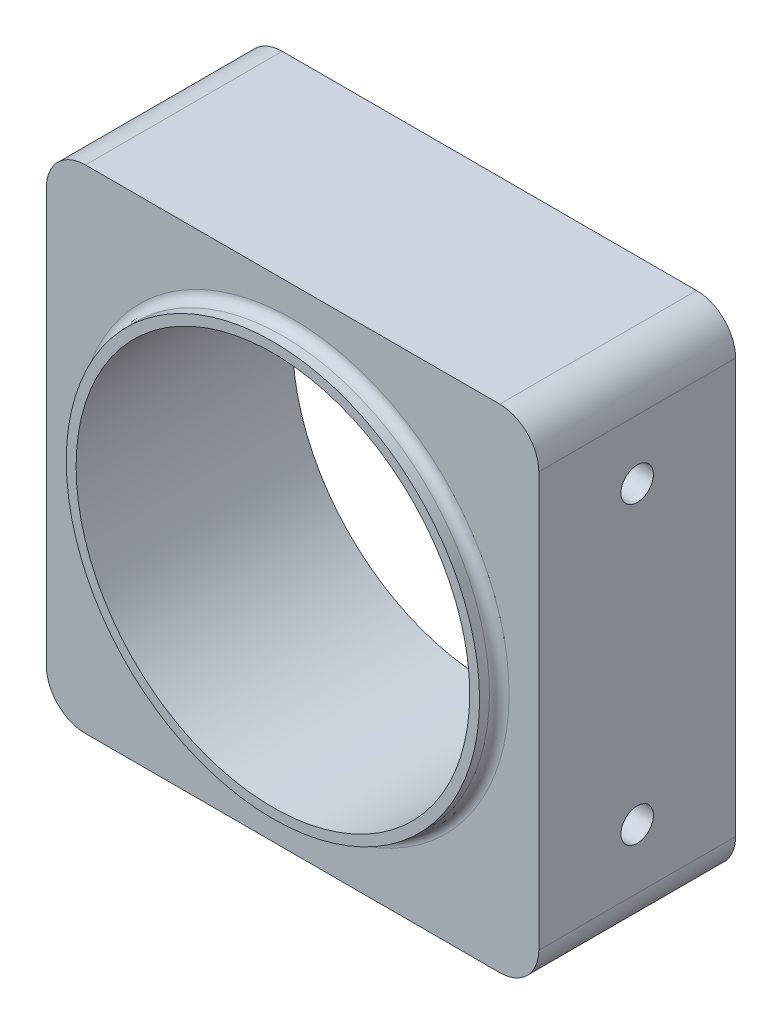
ISO-10303-21;
HEADER;
FILE_DESCRIPTION(('STEP AP214'),'2;1');
FILE_NAME('part.step','',(''),(''),'','','');
FILE_SCHEMA(('AUTOMOTIVE_DESIGN { 1 0 10303 214 1 1 1 1 }'));
ENDSEC;
DATA;
#1=APPLICATION_CONTEXT('core data for automotive mechanical design processes');
#2=APPLICATION_PROTOCOL_DEFINITION('international standard','automotive_design',2000,#1);
#3=PRODUCT_CONTEXT('',#1,'mechanical');
#4=PRODUCT('Part','Part','',(#3));
#5=PRODUCT_RELATED_PRODUCT_CATEGORY('part','',(#4));
#6=PRODUCT_DEFINITION_FORMATION('','',#4);
#7=PRODUCT_DEFINITION_CONTEXT('part definition',#1,'design');
#8=PRODUCT_DEFINITION('design','',#6,#7);
#9=PRODUCT_DEFINITION_SHAPE('','',#8);
#10=(LENGTH_UNIT() NAMED_UNIT(*) SI_UNIT(.MILLI.,.METRE.));
#11=(NAMED_UNIT(*) PLANE_ANGLE_UNIT() SI_UNIT($,.RADIAN.));
#12=(NAMED_UNIT(*) SI_UNIT($,.STERADIAN.) SOLID_ANGLE_UNIT());
#13=UNCERTAINTY_MEASURE_WITH_UNIT(LENGTH_MEASURE(1.E-05),#10,'distance_accuracy_value','');
#14=(GEOMETRIC_REPRESENTATION_CONTEXT(3) GLOBAL_UNCERTAINTY_ASSIGNED_CONTEXT((#13)) GLOBAL_UNIT_ASSIGNED_CONTEXT((#10,
#11,#12)) REPRESENTATION_CONTEXT('',''));
#15=CARTESIAN_POINT('',(0.,0.,0.));
#16=DIRECTION('',(0.,0.,1.));
#17=DIRECTION('',(1.,0.,0.));
#18=AXIS2_PLACEMENT_3D('',#15,#16,#17);
#19=CARTESIAN_POINT('',(0.,0.,20.));
#20=DIRECTION('',(0.,0.,-1.));
#21=DIRECTION('',(-1.,0.,0.));
#22=AXIS2_PLACEMENT_3D('',#19,#20,#21);
#23=PLANE('',#22);
#24=CARTESIAN_POINT('',(0.,0.,20.));
#25=DIRECTION('',(0.,0.,-1.));
#26=DIRECTION('',(-1.,0.,0.));
#27=AXIS2_PLACEMENT_3D('',#24,#25,#26);
#28=CIRCLE('',#27,22.);
#29=CARTESIAN_POINT('',(-22.,0.,20.));
#30=VERTEX_POINT('',#29);
#31=EDGE_CURVE('E11',#30,#30,#28,.T.);
#32=ORIENTED_EDGE('',*,*,#31,.T.);
#33=EDGE_LOOP('',(#32));
#34=FACE_BOUND('',#33,.T.);
#35=DIRECTION('',(0.,1.,0.));
#36=VECTOR('',#35,1.);
#37=CARTESIAN_POINT('',(25.019,-25.019,20.));
#38=LINE('',#37,#36);
#39=CARTESIAN_POINT('',(25.019,-21.05025,20.));
#40=VERTEX_POINT('',#39);
#41=CARTESIAN_POINT('',(25.019,21.05025,20.));
#42=VERTEX_POINT('',#41);
#43=EDGE_CURVE('E169',#40,#42,#38,.T.);
#44=ORIENTED_EDGE('',*,*,#43,.T.);
#45=CARTESIAN_POINT('',(21.05025,21.05025,20.));
#46=DIRECTION('',(0.,0.,-1.));
#47=DIRECTION('',(-1.,0.,0.));
#48=AXIS2_PLACEMENT_3D('',#45,#46,#47);
#49=CIRCLE('',#48,3.96875);
#50=CARTESIAN_POINT('',(21.05025,25.019,20.));
#51=VERTEX_POINT('',#50);
#52=EDGE_CURVE('E231',#42,#51,#49,.F.);
#53=ORIENTED_EDGE('',*,*,#52,.T.);
#54=DIRECTION('',(-1.,0.,0.));
#55=VECTOR('',#54,1.);
#56=CARTESIAN_POINT('',(-25.019,25.019,20.));
#57=LINE('',#56,#55);
#58=CARTESIAN_POINT('',(-21.05025,25.019,20.));
#59=VERTEX_POINT('',#58);
#60=EDGE_CURVE('E173',#51,#59,#57,.T.);
#61=ORIENTED_EDGE('',*,*,#60,.T.);
#62=CARTESIAN_POINT('',(-21.05025,21.05025,20.));
#63=DIRECTION('',(0.,0.,-1.));
#64=DIRECTION('',(-1.,0.,0.));
#65=AXIS2_PLACEMENT_3D('',#62,#63,#64);
#66=CIRCLE('',#65,3.96875);
#67=CARTESIAN_POINT('',(-25.019,21.05025,20.));
#68=VERTEX_POINT('',#67);
#69=EDGE_CURVE('E223',#59,#68,#66,.F.);
#70=ORIENTED_EDGE('',*,*,#69,.T.);
#71=DIRECTION('',(0.,-1.,0.));
#72=VECTOR('',#71,1.);
#73=CARTESIAN_POINT('',(-25.019,-25.019,20.));
#74=LINE('',#73,#72);
#75=CARTESIAN_POINT('',(-25.019,-21.05025,20.));
#76=VERTEX_POINT('',#75);
#77=EDGE_CURVE('E178',#68,#76,#74,.T.);
#78=ORIENTED_EDGE('',*,*,#77,.T.);
#79=CARTESIAN_POINT('',(-21.05025,-21.05025,20.));
#80=DIRECTION('',(0.,0.,-1.));
#81=DIRECTION('',(-1.,0.,0.));
#82=AXIS2_PLACEMENT_3D('',#79,#80,#81);
#83=CIRCLE('',#82,3.96875);
#84=CARTESIAN_POINT('',(-21.05025,-25.019,20.));
#85=VERTEX_POINT('',#84);
#86=EDGE_CURVE('E66',#76,#85,#83,.F.);
#87=ORIENTED_EDGE('',*,*,#86,.T.);
#88=DIRECTION('',(1.,0.,0.));
#89=VECTOR('',#88,1.);
#90=CARTESIAN_POINT('',(-25.019,-25.019,20.));
#91=LINE('',#90,#89);
#92=CARTESIAN_POINT('',(21.05025,-25.019,20.));
#93=VERTEX_POINT('',#92);
#94=EDGE_CURVE('E181',#85,#93,#91,.T.);
#95=ORIENTED_EDGE('',*,*,#94,.T.);
#96=CARTESIAN_POINT('',(21.05025,-21.05025,20.));
#97=DIRECTION('',(0.,0.,-1.));
#98=DIRECTION('',(-1.,0.,0.));
#99=AXIS2_PLACEMENT_3D('',#96,#97,#98);
#100=CIRCLE('',#99,3.96875);
#101=EDGE_CURVE('E228',#93,#40,#100,.F.);
#102=ORIENTED_EDGE('',*,*,#101,.T.);
#103=EDGE_LOOP('',(#44,#53,#61,#70,#78,#87,#95,#102));
#104=FACE_BOUND('',#103,.T.);
#105=ADVANCED_FACE('F43',(#34,#104),#23,.F.);
#106=CARTESIAN_POINT('',(0.,0.,0.));
#107=DIRECTION('',(0.,0.,-1.));
#108=DIRECTION('',(-1.,0.,0.));
#109=AXIS2_PLACEMENT_3D('',#106,#107,#108);
#110=PLANE('',#109);
#111=DIRECTION('',(-1.,0.,0.));
#112=VECTOR('',#111,1.);
#113=CARTESIAN_POINT('',(-25.019,25.019,0.));
#114=LINE('',#113,#112);
#115=CARTESIAN_POINT('',(21.05025,25.019,0.));
#116=VERTEX_POINT('',#115);
#117=CARTESIAN_POINT('',(-21.05025,25.019,0.));
#118=VERTEX_POINT('',#117);
#119=EDGE_CURVE('E188',#116,#118,#114,.T.);
#120=ORIENTED_EDGE('',*,*,#119,.F.);
#121=CARTESIAN_POINT('',(21.05025,21.05025,0.));
#122=DIRECTION('',(0.,0.,-1.));
#123=DIRECTION('',(-1.,0.,0.));
#124=AXIS2_PLACEMENT_3D('',#121,#122,#123);
#125=CIRCLE('',#124,3.96875);
#126=CARTESIAN_POINT('',(25.019,21.05025,0.));
#127=VERTEX_POINT('',#126);
#128=EDGE_CURVE('E213',#116,#127,#125,.T.);
#129=ORIENTED_EDGE('',*,*,#128,.T.);
#130=DIRECTION('',(0.,1.,0.));
#131=VECTOR('',#130,1.);
#132=CARTESIAN_POINT('',(25.019,-25.019,0.));
#133=LINE('',#132,#131);
#134=CARTESIAN_POINT('',(25.019,-21.05025,0.));
#135=VERTEX_POINT('',#134);
#136=EDGE_CURVE('E168',#135,#127,#133,.T.);
#137=ORIENTED_EDGE('',*,*,#136,.F.);
#138=CARTESIAN_POINT('',(21.05025,-21.05025,0.));
#139=DIRECTION('',(0.,0.,-1.));
#140=DIRECTION('',(-1.,0.,0.));
#141=AXIS2_PLACEMENT_3D('',#138,#139,#140);
#142=CIRCLE('',#141,3.96875);
#143=CARTESIAN_POINT('',(21.05025,-25.019,0.));
#144=VERTEX_POINT('',#143);
#145=EDGE_CURVE('E210',#135,#144,#142,.T.);
#146=ORIENTED_EDGE('',*,*,#145,.T.);
#147=DIRECTION('',(1.,0.,0.));
#148=VECTOR('',#147,1.);
#149=CARTESIAN_POINT('',(-25.019,-25.019,0.));
#150=LINE('',#149,#148);
#151=CARTESIAN_POINT('',(-21.05025,-25.019,0.));
#152=VERTEX_POINT('',#151);
#153=EDGE_CURVE('E174',#152,#144,#150,.T.);
#154=ORIENTED_EDGE('',*,*,#153,.F.);
#155=CARTESIAN_POINT('',(-21.05025,-21.05025,0.));
#156=DIRECTION('',(0.,0.,-1.));
#157=DIRECTION('',(-1.,0.,0.));
#158=AXIS2_PLACEMENT_3D('',#155,#156,#157);
#159=CIRCLE('',#158,3.96875);
#160=CARTESIAN_POINT('',(-25.019,-21.05025,0.));
#161=VERTEX_POINT('',#160);
#162=EDGE_CURVE('E207',#152,#161,#159,.T.);
#163=ORIENTED_EDGE('',*,*,#162,.T.);
#164=DIRECTION('',(0.,-1.,0.));
#165=VECTOR('',#164,1.);
#166=CARTESIAN_POINT('',(-25.019,-25.019,0.));
#167=LINE('',#166,#165);
#168=CARTESIAN_POINT('',(-25.019,21.05025,0.));
#169=VERTEX_POINT('',#168);
#170=EDGE_CURVE('E192',#169,#161,#167,.T.);
#171=ORIENTED_EDGE('',*,*,#170,.F.);
#172=CARTESIAN_POINT('',(-21.05025,21.05025,0.));
#173=DIRECTION('',(0.,0.,-1.));
#174=DIRECTION('',(-1.,0.,0.));
#175=AXIS2_PLACEMENT_3D('',#172,#173,#174);
#176=CIRCLE('',#175,3.96875);
#177=EDGE_CURVE('E204',#169,#118,#176,.T.);
#178=ORIENTED_EDGE('',*,*,#177,.T.);
#179=EDGE_LOOP('',(#120,#129,#137,#146,#154,#163,#171,#178));
#180=FACE_BOUND('',#179,.T.);
#181=CARTESIAN_POINT('',(0.,0.,0.));
#182=DIRECTION('',(0.,0.,1.));
#183=DIRECTION('',(1.,0.,0.));
#184=AXIS2_PLACEMENT_3D('',#181,#182,#183);
#185=CIRCLE('',#184,20.);
#186=CARTESIAN_POINT('',(20.,0.,0.));
#187=VERTEX_POINT('',#186);
#188=EDGE_CURVE('E164',#187,#187,#185,.T.);
#189=ORIENTED_EDGE('',*,*,#188,.T.);
#190=EDGE_LOOP('',(#189));
#191=FACE_BOUND('',#190,.T.);
#192=ADVANCED_FACE('F262',(#180,#191),#110,.T.);
#193=CARTESIAN_POINT('',(25.019,-25.019,20.));
#194=DIRECTION('',(-1.,0.,0.));
#195=DIRECTION('',(0.,0.,1.));
#196=AXIS2_PLACEMENT_3D('',#193,#194,#195);
#197=PLANE('',#196);
#198=CARTESIAN_POINT('',(25.019,15.,10.));
#199=DIRECTION('',(1.,0.,0.));
#200=DIRECTION('',(0.,0.,-1.));
#201=AXIS2_PLACEMENT_3D('',#198,#199,#200);
#202=CIRCLE('',#201,1.65);
#203=CARTESIAN_POINT('',(25.019,15.,8.35));
#204=VERTEX_POINT('',#203);
#205=EDGE_CURVE('E133',#204,#204,#202,.T.);
#206=ORIENTED_EDGE('',*,*,#205,.F.);
#207=EDGE_LOOP('',(#206));
#208=FACE_BOUND('',#207,.T.);
#209=CARTESIAN_POINT('',(25.019,-15.,10.));
#210=DIRECTION('',(1.,0.,0.));
#211=DIRECTION('',(0.,0.,-1.));
#212=AXIS2_PLACEMENT_3D('',#209,#210,#211);
#213=CIRCLE('',#212,1.65);
#214=CARTESIAN_POINT('',(25.019,-15.,8.35));
#215=VERTEX_POINT('',#214);
#216=EDGE_CURVE('E132',#215,#215,#213,.T.);
#217=ORIENTED_EDGE('',*,*,#216,.F.);
#218=EDGE_LOOP('',(#217));
#219=FACE_BOUND('',#218,.T.);
#220=ORIENTED_EDGE('',*,*,#136,.T.);
#221=DIRECTION('',(0.,0.,-1.));
#222=VECTOR('',#221,1.);
#223=CARTESIAN_POINT('',(25.019,21.05025,20.));
#224=LINE('',#223,#222);
#225=EDGE_CURVE('E220',#127,#42,#224,.F.);
#226=ORIENTED_EDGE('',*,*,#225,.T.);
#227=ORIENTED_EDGE('',*,*,#43,.F.);
#228=DIRECTION('',(0.,0.,-1.));
#229=VECTOR('',#228,1.);
#230=CARTESIAN_POINT('',(25.019,-21.05025,20.));
#231=LINE('',#230,#229);
#232=EDGE_CURVE('E216',#40,#135,#231,.T.);
#233=ORIENTED_EDGE('',*,*,#232,.T.);
#234=EDGE_LOOP('',(#220,#226,#227,#233));
#235=FACE_BOUND('',#234,.T.);
#236=ADVANCED_FACE('F268',(#208,#219,#235),#197,.F.);
#237=CARTESIAN_POINT('',(-25.019,25.019,20.));
#238=DIRECTION('',(0.,-1.,0.));
#239=DIRECTION('',(0.,0.,-1.));
#240=AXIS2_PLACEMENT_3D('',#237,#238,#239);
#241=PLANE('',#240);
#242=ORIENTED_EDGE('',*,*,#60,.F.);
#243=DIRECTION('',(0.,0.,-1.));
#244=VECTOR('',#243,1.);
#245=CARTESIAN_POINT('',(21.05025,25.019,20.));
#246=LINE('',#245,#244);
#247=EDGE_CURVE('E200',#51,#116,#246,.T.);
#248=ORIENTED_EDGE('',*,*,#247,.T.);
#249=ORIENTED_EDGE('',*,*,#119,.T.);
#250=DIRECTION('',(0.,0.,-1.));
#251=VECTOR('',#250,1.);
#252=CARTESIAN_POINT('',(-21.05025,25.019,20.));
#253=LINE('',#252,#251);
#254=EDGE_CURVE('E184',#118,#59,#253,.F.);
#255=ORIENTED_EDGE('',*,*,#254,.T.);
#256=EDGE_LOOP('',(#242,#248,#249,#255));
#257=FACE_BOUND('',#256,.T.);
#258=ADVANCED_FACE('F281',(#257),#241,.F.);
#259=CARTESIAN_POINT('',(-25.019,-25.019,20.));
#260=DIRECTION('',(1.,0.,0.));
#261=DIRECTION('',(0.,0.,-1.));
#262=AXIS2_PLACEMENT_3D('',#259,#260,#261);
#263=PLANE('',#262);
#264=CARTESIAN_POINT('',(-25.019,15.,10.));
#265=DIRECTION('',(-1.,0.,0.));
#266=DIRECTION('',(0.,0.,1.));
#267=AXIS2_PLACEMENT_3D('',#264,#265,#266);
#268=CIRCLE('',#267,1.65);
#269=CARTESIAN_POINT('',(-25.019,15.,11.65));
#270=VERTEX_POINT('',#269);
#271=EDGE_CURVE('E148',#270,#270,#268,.T.);
#272=ORIENTED_EDGE('',*,*,#271,.F.);
#273=EDGE_LOOP('',(#272));
#274=FACE_BOUND('',#273,.T.);
#275=CARTESIAN_POINT('',(-25.019,-15.,10.));
#276=DIRECTION('',(-1.,0.,0.));
#277=DIRECTION('',(0.,0.,1.));
#278=AXIS2_PLACEMENT_3D('',#275,#276,#277);
#279=CIRCLE('',#278,1.65);
#280=CARTESIAN_POINT('',(-25.019,-15.,11.65));
#281=VERTEX_POINT('',#280);
#282=EDGE_CURVE('E156',#281,#281,#279,.T.);
#283=ORIENTED_EDGE('',*,*,#282,.F.);
#284=EDGE_LOOP('',(#283));
#285=FACE_BOUND('',#284,.T.);
#286=ORIENTED_EDGE('',*,*,#170,.T.);
#287=DIRECTION('',(0.,0.,-1.));
#288=VECTOR('',#287,1.);
#289=CARTESIAN_POINT('',(-25.019,-21.05025,20.));
#290=LINE('',#289,#288);
#291=EDGE_CURVE('E244',#161,#76,#290,.F.);
#292=ORIENTED_EDGE('',*,*,#291,.T.);
#293=ORIENTED_EDGE('',*,*,#77,.F.);
#294=DIRECTION('',(0.,0.,-1.));
#295=VECTOR('',#294,1.);
#296=CARTESIAN_POINT('',(-25.019,21.05025,20.));
#297=LINE('',#296,#295);
#298=EDGE_CURVE('E240',#68,#169,#297,.T.);
#299=ORIENTED_EDGE('',*,*,#298,.T.);
#300=EDGE_LOOP('',(#286,#292,#293,#299));
#301=FACE_BOUND('',#300,.T.);
#302=ADVANCED_FACE('F278',(#274,#285,#301),#263,.F.);
#303=CARTESIAN_POINT('',(-25.019,-25.019,20.));
#304=DIRECTION('',(0.,1.,0.));
#305=DIRECTION('',(0.,0.,1.));
#306=AXIS2_PLACEMENT_3D('',#303,#304,#305);
#307=PLANE('',#306);
#308=ORIENTED_EDGE('',*,*,#153,.T.);
#309=DIRECTION('',(0.,0.,-1.));
#310=VECTOR('',#309,1.);
#311=CARTESIAN_POINT('',(21.05025,-25.019,20.));
#312=LINE('',#311,#310);
#313=EDGE_CURVE('E59',#144,#93,#312,.F.);
#314=ORIENTED_EDGE('',*,*,#313,.T.);
#315=ORIENTED_EDGE('',*,*,#94,.F.);
#316=DIRECTION('',(0.,0.,-1.));
#317=VECTOR('',#316,1.);
#318=CARTESIAN_POINT('',(-21.05025,-25.019,20.));
#319=LINE('',#318,#317);
#320=EDGE_CURVE('E234',#85,#152,#319,.T.);
#321=ORIENTED_EDGE('',*,*,#320,.T.);
#322=EDGE_LOOP('',(#308,#314,#315,#321));
#323=FACE_BOUND('',#322,.T.);
#324=ADVANCED_FACE('F275',(#323),#307,.F.);
#325=CARTESIAN_POINT('',(0.,0.,20.));
#326=DIRECTION('',(0.,0.,-1.));
#327=DIRECTION('',(-1.,0.,0.));
#328=AXIS2_PLACEMENT_3D('',#325,#326,#327);
#329=CYLINDRICAL_SURFACE('',#328,20.);
#330=ORIENTED_EDGE('',*,*,#188,.F.);
#331=EDGE_LOOP('',(#330));
#332=FACE_BOUND('',#331,.T.);
#333=CARTESIAN_POINT('',(0.,0.,22.));
#334=DIRECTION('',(0.,0.,1.));
#335=DIRECTION('',(1.,0.,0.));
#336=AXIS2_PLACEMENT_3D('',#333,#334,#335);
#337=CIRCLE('',#336,20.);
#338=CARTESIAN_POINT('',(20.,0.,22.));
#339=VERTEX_POINT('',#338);
#340=EDGE_CURVE('E335',#339,#339,#337,.T.);
#341=ORIENTED_EDGE('',*,*,#340,.T.);
#342=EDGE_LOOP('',(#341));
#343=FACE_BOUND('',#342,.T.);
#344=ADVANCED_FACE('F272',(#332,#343),#329,.F.);
#345=CARTESIAN_POINT('',(21.05025,21.05025,20.));
#346=DIRECTION('',(0.,0.,-1.));
#347=DIRECTION('',(-1.,0.,0.));
#348=AXIS2_PLACEMENT_3D('',#345,#346,#347);
#349=CYLINDRICAL_SURFACE('',#348,3.96875);
#350=ORIENTED_EDGE('',*,*,#52,.F.);
#351=ORIENTED_EDGE('',*,*,#225,.F.);
#352=ORIENTED_EDGE('',*,*,#128,.F.);
#353=ORIENTED_EDGE('',*,*,#247,.F.);
#354=EDGE_LOOP('',(#350,#351,#352,#353));
#355=FACE_BOUND('',#354,.T.);
#356=ADVANCED_FACE('F289',(#355),#349,.T.);
#357=CARTESIAN_POINT('',(21.05025,-21.05025,20.));
#358=DIRECTION('',(0.,0.,-1.));
#359=DIRECTION('',(-1.,0.,0.));
#360=AXIS2_PLACEMENT_3D('',#357,#358,#359);
#361=CYLINDRICAL_SURFACE('',#360,3.96875);
#362=ORIENTED_EDGE('',*,*,#101,.F.);
#363=ORIENTED_EDGE('',*,*,#313,.F.);
#364=ORIENTED_EDGE('',*,*,#145,.F.);
#365=ORIENTED_EDGE('',*,*,#232,.F.);
#366=EDGE_LOOP('',(#362,#363,#364,#365));
#367=FACE_BOUND('',#366,.T.);
#368=ADVANCED_FACE('F292',(#367),#361,.T.);
#369=CARTESIAN_POINT('',(-21.05025,-21.05025,20.));
#370=DIRECTION('',(0.,0.,-1.));
#371=DIRECTION('',(-1.,0.,0.));
#372=AXIS2_PLACEMENT_3D('',#369,#370,#371);
#373=CYLINDRICAL_SURFACE('',#372,3.96875);
#374=ORIENTED_EDGE('',*,*,#86,.F.);
#375=ORIENTED_EDGE('',*,*,#291,.F.);
#376=ORIENTED_EDGE('',*,*,#162,.F.);
#377=ORIENTED_EDGE('',*,*,#320,.F.);
#378=EDGE_LOOP('',(#374,#375,#376,#377));
#379=FACE_BOUND('',#378,.T.);
#380=ADVANCED_FACE('F296',(#379),#373,.T.);
#381=CARTESIAN_POINT('',(-21.05025,21.05025,20.));
#382=DIRECTION('',(0.,0.,-1.));
#383=DIRECTION('',(-1.,0.,0.));
#384=AXIS2_PLACEMENT_3D('',#381,#382,#383);
#385=CYLINDRICAL_SURFACE('',#384,3.96875);
#386=ORIENTED_EDGE('',*,*,#69,.F.);
#387=ORIENTED_EDGE('',*,*,#254,.F.);
#388=ORIENTED_EDGE('',*,*,#177,.F.);
#389=ORIENTED_EDGE('',*,*,#298,.F.);
#390=EDGE_LOOP('',(#386,#387,#388,#389));
#391=FACE_BOUND('',#390,.T.);
#392=ADVANCED_FACE('F299',(#391),#385,.T.);
#393=CARTESIAN_POINT('',(-18.0104200213955,-15.,10.));
#394=DIRECTION('',(-1.,0.,0.));
#395=DIRECTION('',(0.,0.,1.));
#396=AXIS2_PLACEMENT_3D('',#393,#394,#395);
#397=CONICAL_SURFACE('',#396,1.65,1.02974425867665);
#398=CARTESIAN_POINT('',(-17.019,-15.,10.));
#399=VERTEX_POINT('',#398);
#400=VERTEX_LOOP('',#399);
#401=FACE_BOUND('',#400,.T.);
#402=CARTESIAN_POINT('',(-18.0104200213955,-15.,10.));
#403=DIRECTION('',(-1.,0.,0.));
#404=DIRECTION('',(0.,0.,1.));
#405=AXIS2_PLACEMENT_3D('',#402,#403,#404);
#406=CIRCLE('',#405,1.65);
#407=CARTESIAN_POINT('',(-18.0104200213955,-15.,11.65));
#408=VERTEX_POINT('',#407);
#409=EDGE_CURVE('E160',#408,#408,#406,.T.);
#410=ORIENTED_EDGE('',*,*,#409,.T.);
#411=EDGE_LOOP('',(#410));
#412=FACE_BOUND('',#411,.T.);
#413=ADVANCED_FACE('F302',(#401,#412),#397,.F.);
#414=CARTESIAN_POINT('',(-25.019,-15.,10.));
#415=DIRECTION('',(-1.,0.,0.));
#416=DIRECTION('',(0.,0.,1.));
#417=AXIS2_PLACEMENT_3D('',#414,#415,#416);
#418=CYLINDRICAL_SURFACE('',#417,1.65);
#419=ORIENTED_EDGE('',*,*,#409,.F.);
#420=EDGE_LOOP('',(#419));
#421=FACE_BOUND('',#420,.T.);
#422=ORIENTED_EDGE('',*,*,#282,.T.);
#423=EDGE_LOOP('',(#422));
#424=FACE_BOUND('',#423,.T.);
#425=ADVANCED_FACE('F307',(#421,#424),#418,.F.);
#426=CARTESIAN_POINT('',(-18.0104200213955,15.,10.));
#427=DIRECTION('',(-1.,0.,0.));
#428=DIRECTION('',(0.,0.,1.));
#429=AXIS2_PLACEMENT_3D('',#426,#427,#428);
#430=CONICAL_SURFACE('',#429,1.65,1.02974425867665);
#431=CARTESIAN_POINT('',(-17.019,15.,10.));
#432=VERTEX_POINT('',#431);
#433=VERTEX_LOOP('',#432);
#434=FACE_BOUND('',#433,.T.);
#435=CARTESIAN_POINT('',(-18.0104200213955,15.,10.));
#436=DIRECTION('',(-1.,0.,0.));
#437=DIRECTION('',(0.,0.,1.));
#438=AXIS2_PLACEMENT_3D('',#435,#436,#437);
#439=CIRCLE('',#438,1.65);
#440=CARTESIAN_POINT('',(-18.0104200213955,15.,11.65));
#441=VERTEX_POINT('',#440);
#442=EDGE_CURVE('E152',#441,#441,#439,.T.);
#443=ORIENTED_EDGE('',*,*,#442,.T.);
#444=EDGE_LOOP('',(#443));
#445=FACE_BOUND('',#444,.T.);
#446=ADVANCED_FACE('F360',(#434,#445),#430,.F.);
#447=CARTESIAN_POINT('',(-25.019,15.,10.));
#448=DIRECTION('',(-1.,0.,0.));
#449=DIRECTION('',(0.,0.,1.));
#450=AXIS2_PLACEMENT_3D('',#447,#448,#449);
#451=CYLINDRICAL_SURFACE('',#450,1.65);
#452=ORIENTED_EDGE('',*,*,#442,.F.);
#453=EDGE_LOOP('',(#452));
#454=FACE_BOUND('',#453,.T.);
#455=ORIENTED_EDGE('',*,*,#271,.T.);
#456=EDGE_LOOP('',(#455));
#457=FACE_BOUND('',#456,.T.);
#458=ADVANCED_FACE('F356',(#454,#457),#451,.F.);
#459=CARTESIAN_POINT('',(18.0104200213955,-15.,10.));
#460=DIRECTION('',(1.,0.,0.));
#461=DIRECTION('',(0.,0.,-1.));
#462=AXIS2_PLACEMENT_3D('',#459,#460,#461);
#463=CONICAL_SURFACE('',#462,1.65,1.02974425867665);
#464=CARTESIAN_POINT('',(17.019,-15.,10.));
#465=VERTEX_POINT('',#464);
#466=VERTEX_LOOP('',#465);
#467=FACE_BOUND('',#466,.T.);
#468=CARTESIAN_POINT('',(18.0104200213955,-15.,10.));
#469=DIRECTION('',(1.,0.,0.));
#470=DIRECTION('',(0.,0.,-1.));
#471=AXIS2_PLACEMENT_3D('',#468,#469,#470);
#472=CIRCLE('',#471,1.65);
#473=CARTESIAN_POINT('',(18.0104200213955,-15.,8.35));
#474=VERTEX_POINT('',#473);
#475=EDGE_CURVE('E138',#474,#474,#472,.T.);
#476=ORIENTED_EDGE('',*,*,#475,.T.);
#477=EDGE_LOOP('',(#476));
#478=FACE_BOUND('',#477,.T.);
#479=ADVANCED_FACE('F352',(#467,#478),#463,.F.);
#480=CARTESIAN_POINT('',(25.019,-15.,10.));
#481=DIRECTION('',(1.,0.,0.));
#482=DIRECTION('',(0.,0.,-1.));
#483=AXIS2_PLACEMENT_3D('',#480,#481,#482);
#484=CYLINDRICAL_SURFACE('',#483,1.65);
#485=ORIENTED_EDGE('',*,*,#475,.F.);
#486=EDGE_LOOP('',(#485));
#487=FACE_BOUND('',#486,.T.);
#488=ORIENTED_EDGE('',*,*,#216,.T.);
#489=EDGE_LOOP('',(#488));
#490=FACE_BOUND('',#489,.T.);
#491=ADVANCED_FACE('F125',(#487,#490),#484,.F.);
#492=CARTESIAN_POINT('',(18.0104200213955,15.,10.));
#493=DIRECTION('',(1.,0.,0.));
#494=DIRECTION('',(0.,0.,-1.));
#495=AXIS2_PLACEMENT_3D('',#492,#493,#494);
#496=CONICAL_SURFACE('',#495,1.65,1.02974425867665);
#497=CARTESIAN_POINT('',(17.019,15.,10.));
#498=VERTEX_POINT('',#497);
#499=VERTEX_LOOP('',#498);
#500=FACE_BOUND('',#499,.T.);
#501=CARTESIAN_POINT('',(18.0104200213955,15.,10.));
#502=DIRECTION('',(1.,0.,0.));
#503=DIRECTION('',(0.,0.,-1.));
#504=AXIS2_PLACEMENT_3D('',#501,#502,#503);
#505=CIRCLE('',#504,1.65);
#506=CARTESIAN_POINT('',(18.0104200213955,15.,8.35));
#507=VERTEX_POINT('',#506);
#508=EDGE_CURVE('E129',#507,#507,#505,.T.);
#509=ORIENTED_EDGE('',*,*,#508,.T.);
#510=EDGE_LOOP('',(#509));
#511=FACE_BOUND('',#510,.T.);
#512=ADVANCED_FACE('F121',(#500,#511),#496,.F.);
#513=CARTESIAN_POINT('',(25.019,15.,10.));
#514=DIRECTION('',(1.,0.,0.));
#515=DIRECTION('',(0.,0.,-1.));
#516=AXIS2_PLACEMENT_3D('',#513,#514,#515);
#517=CYLINDRICAL_SURFACE('',#516,1.65);
#518=ORIENTED_EDGE('',*,*,#508,.F.);
#519=EDGE_LOOP('',(#518));
#520=FACE_BOUND('',#519,.T.);
#521=ORIENTED_EDGE('',*,*,#205,.T.);
#522=EDGE_LOOP('',(#521));
#523=FACE_BOUND('',#522,.T.);
#524=ADVANCED_FACE('F124',(#520,#523),#517,.F.);
#525=CARTESIAN_POINT('',(0.,0.,22.));
#526=DIRECTION('',(0.,0.,1.));
#527=DIRECTION('',(1.,0.,0.));
#528=AXIS2_PLACEMENT_3D('',#525,#526,#527);
#529=PLANE('',#528);
#530=CARTESIAN_POINT('',(0.,0.,22.));
#531=DIRECTION('',(0.,0.,1.));
#532=DIRECTION('',(1.,0.,0.));
#533=AXIS2_PLACEMENT_3D('',#530,#531,#532);
#534=CIRCLE('',#533,21.);
#535=CARTESIAN_POINT('',(21.,0.,22.));
#536=VERTEX_POINT('',#535);
#537=EDGE_CURVE('E141',#536,#536,#534,.T.);
#538=ORIENTED_EDGE('',*,*,#537,.T.);
#539=EDGE_LOOP('',(#538));
#540=FACE_BOUND('',#539,.T.);
#541=ORIENTED_EDGE('',*,*,#340,.F.);
#542=EDGE_LOOP('',(#541));
#543=FACE_BOUND('',#542,.T.);
#544=ADVANCED_FACE('F258',(#540,#543),#529,.T.);
#545=CARTESIAN_POINT('',(0.,0.,22.));
#546=DIRECTION('',(0.,0.,-1.));
#547=DIRECTION('',(-1.,0.,0.));
#548=AXIS2_PLACEMENT_3D('',#545,#546,#547);
#549=CYLINDRICAL_SURFACE('',#548,21.);
#550=CARTESIAN_POINT('',(0.,0.,21.));
#551=DIRECTION('',(0.,0.,-1.));
#552=DIRECTION('',(-1.,0.,0.));
#553=AXIS2_PLACEMENT_3D('',#550,#551,#552);
#554=CIRCLE('',#553,21.);
#555=CARTESIAN_POINT('',(-21.,0.,21.));
#556=VERTEX_POINT('',#555);
#557=EDGE_CURVE('E52',#556,#556,#554,.F.);
#558=ORIENTED_EDGE('',*,*,#557,.T.);
#559=EDGE_LOOP('',(#558));
#560=FACE_BOUND('',#559,.T.);
#561=ORIENTED_EDGE('',*,*,#537,.F.);
#562=EDGE_LOOP('',(#561));
#563=FACE_BOUND('',#562,.T.);
#564=ADVANCED_FACE('F250',(#560,#563),#549,.T.);
#565=CARTESIAN_POINT('',(0.,0.,21.));
#566=DIRECTION('',(0.,0.,-1.));
#567=DIRECTION('',(-1.,0.,0.));
#568=AXIS2_PLACEMENT_3D('',#565,#566,#567);
#569=TOROIDAL_SURFACE('',#568,22.,1.);
#570=ORIENTED_EDGE('',*,*,#31,.F.);
#571=EDGE_LOOP('',(#570));
#572=FACE_BOUND('',#571,.T.);
#573=ORIENTED_EDGE('',*,*,#557,.F.);
#574=EDGE_LOOP('',(#573));
#575=FACE_BOUND('',#574,.T.);
#576=ADVANCED_FACE('F45',(#572,#575),#569,.F.);
#577=CLOSED_SHELL('',(#105,#192,#236,#258,#302,#324,#344,#356,#368,#380,#392,#413,#425,#446,
#458,#479,#491,#512,#524,#544,#564,#576));
#578=MANIFOLD_SOLID_BREP('B2',#577);
#579=ADVANCED_BREP_SHAPE_REPRESENTATION('',(#18,#578),#14);
#580=SHAPE_DEFINITION_REPRESENTATION(#9,#579);
ENDSEC;
END-ISO-10303-21;
